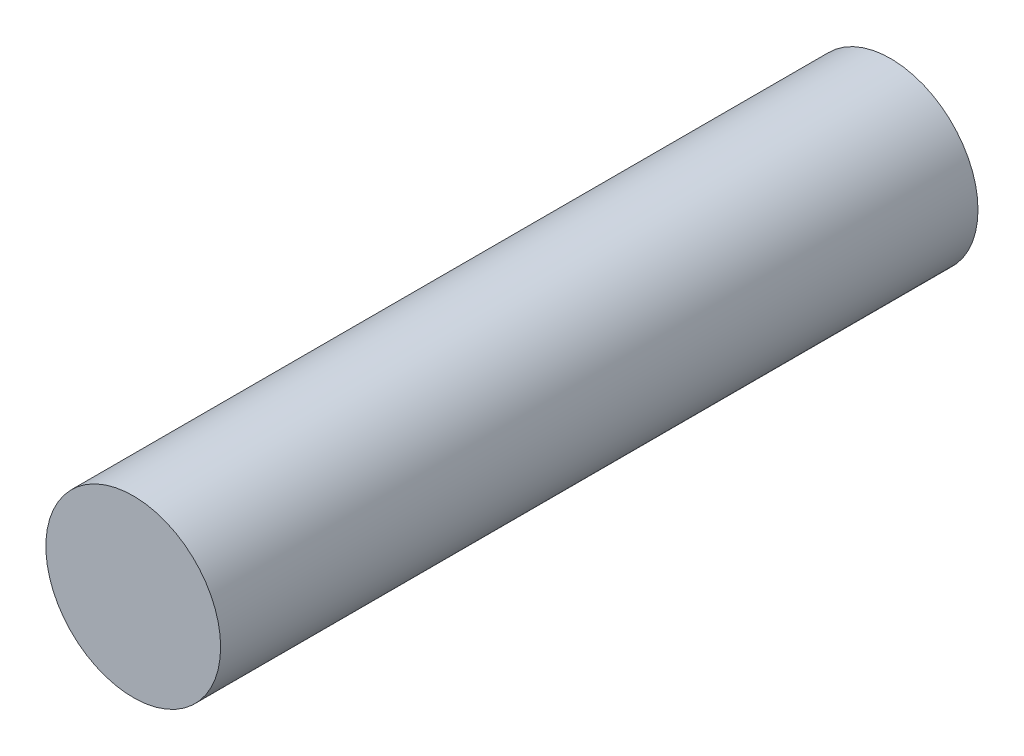
ISO-10303-21;
HEADER;
FILE_DESCRIPTION(('STEP AP214'),'2;1');
FILE_NAME('part.step','',(''),(''),'','','');
FILE_SCHEMA(('AUTOMOTIVE_DESIGN { 1 0 10303 214 1 1 1 1 }'));
ENDSEC;
DATA;
#1=APPLICATION_CONTEXT('core data for automotive mechanical design processes');
#2=APPLICATION_PROTOCOL_DEFINITION('international standard','automotive_design',2000,#1);
#3=PRODUCT_CONTEXT('',#1,'mechanical');
#4=PRODUCT('Part','Part','',(#3));
#5=PRODUCT_RELATED_PRODUCT_CATEGORY('part','',(#4));
#6=PRODUCT_DEFINITION_FORMATION('','',#4);
#7=PRODUCT_DEFINITION_CONTEXT('part definition',#1,'design');
#8=PRODUCT_DEFINITION('design','',#6,#7);
#9=PRODUCT_DEFINITION_SHAPE('','',#8);
#10=(LENGTH_UNIT() NAMED_UNIT(*) SI_UNIT(.MILLI.,.METRE.));
#11=(NAMED_UNIT(*) PLANE_ANGLE_UNIT() SI_UNIT($,.RADIAN.));
#12=(NAMED_UNIT(*) SI_UNIT($,.STERADIAN.) SOLID_ANGLE_UNIT());
#13=UNCERTAINTY_MEASURE_WITH_UNIT(LENGTH_MEASURE(1.E-05),#10,'distance_accuracy_value','');
#14=(GEOMETRIC_REPRESENTATION_CONTEXT(3) GLOBAL_UNCERTAINTY_ASSIGNED_CONTEXT((#13)) GLOBAL_UNIT_ASSIGNED_CONTEXT((#10,
#11,#12)) REPRESENTATION_CONTEXT('',''));
#15=CARTESIAN_POINT('',(0.,0.,0.));
#16=DIRECTION('',(0.,0.,1.));
#17=DIRECTION('',(1.,0.,0.));
#18=AXIS2_PLACEMENT_3D('',#15,#16,#17);
#19=CARTESIAN_POINT('',(0.,0.,19.5));
#20=DIRECTION('',(0.,0.,-1.));
#21=DIRECTION('',(-1.,0.,0.));
#22=AXIS2_PLACEMENT_3D('',#19,#20,#21);
#23=CYLINDRICAL_SURFACE('',#22,2.25);
#24=CARTESIAN_POINT('',(0.,0.,19.5));
#25=DIRECTION('',(0.,0.,1.));
#26=DIRECTION('',(1.,0.,0.));
#27=AXIS2_PLACEMENT_3D('',#24,#25,#26);
#28=CIRCLE('',#27,2.25);
#29=CARTESIAN_POINT('',(2.25,0.,19.5));
#30=VERTEX_POINT('',#29);
#31=EDGE_CURVE('E10',#30,#30,#28,.T.);
#32=ORIENTED_EDGE('',*,*,#31,.F.);
#33=EDGE_LOOP('',(#32));
#34=FACE_BOUND('',#33,.T.);
#35=CARTESIAN_POINT('',(0.,0.,0.));
#36=DIRECTION('',(0.,0.,1.));
#37=DIRECTION('',(1.,0.,0.));
#38=AXIS2_PLACEMENT_3D('',#35,#36,#37);
#39=CIRCLE('',#38,2.25);
#40=CARTESIAN_POINT('',(2.25,0.,0.));
#41=VERTEX_POINT('',#40);
#42=EDGE_CURVE('E36',#41,#41,#39,.T.);
#43=ORIENTED_EDGE('',*,*,#42,.T.);
#44=EDGE_LOOP('',(#43));
#45=FACE_BOUND('',#44,.T.);
#46=ADVANCED_FACE('F33',(#34,#45),#23,.T.);
#47=CARTESIAN_POINT('',(0.,0.,19.5));
#48=DIRECTION('',(0.,0.,1.));
#49=DIRECTION('',(1.,0.,0.));
#50=AXIS2_PLACEMENT_3D('',#47,#48,#49);
#51=PLANE('',#50);
#52=ORIENTED_EDGE('',*,*,#31,.T.);
#53=EDGE_LOOP('',(#52));
#54=FACE_BOUND('',#53,.T.);
#55=ADVANCED_FACE('F48',(#54),#51,.T.);
#56=CARTESIAN_POINT('',(0.,0.,0.));
#57=DIRECTION('',(0.,0.,1.));
#58=DIRECTION('',(1.,0.,0.));
#59=AXIS2_PLACEMENT_3D('',#56,#57,#58);
#60=PLANE('',#59);
#61=ORIENTED_EDGE('',*,*,#42,.F.);
#62=EDGE_LOOP('',(#61));
#63=FACE_BOUND('',#62,.T.);
#64=ADVANCED_FACE('F46',(#63),#60,.F.);
#65=CLOSED_SHELL('',(#46,#55,#64));
#66=MANIFOLD_SOLID_BREP('B2',#65);
#67=ADVANCED_BREP_SHAPE_REPRESENTATION('',(#18,#66),#14);
#68=SHAPE_DEFINITION_REPRESENTATION(#9,#67);
ENDSEC;
END-ISO-10303-21;
